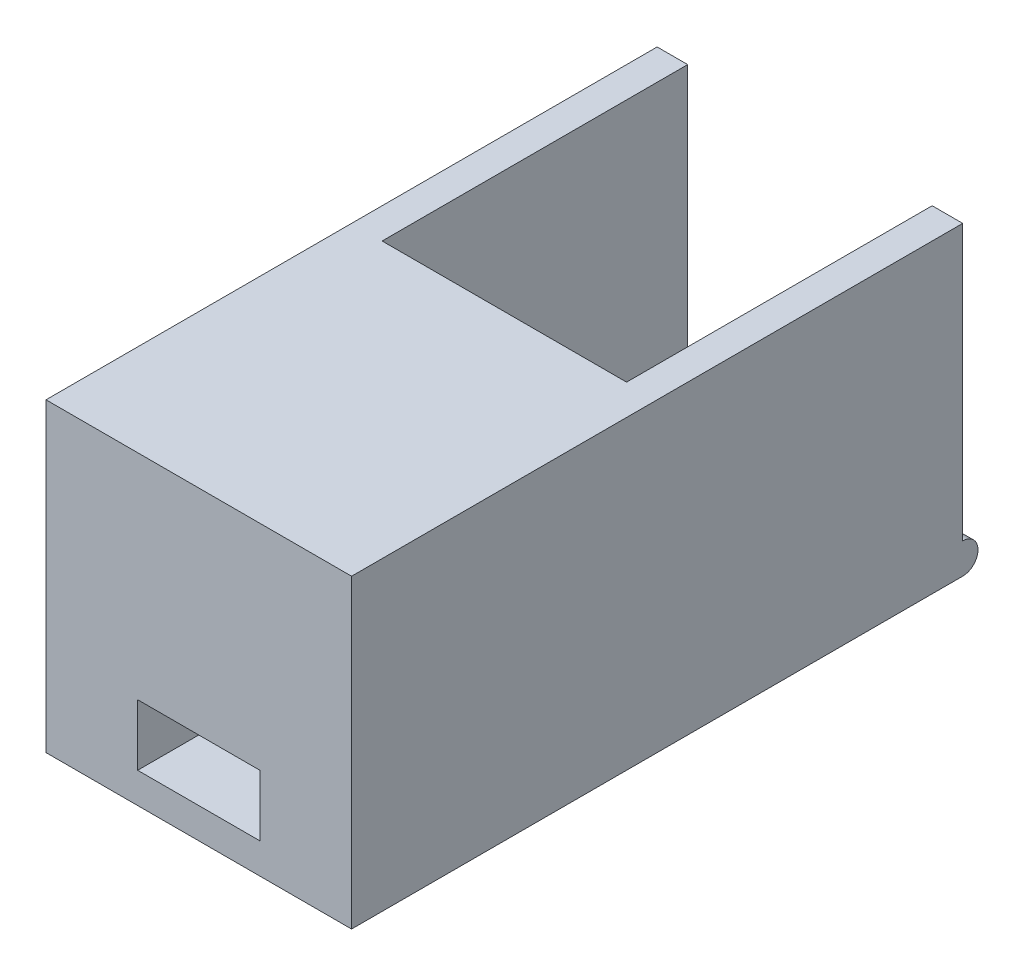
ISO-10303-21;
HEADER;
FILE_DESCRIPTION(('STEP AP214'),'2;1');
FILE_NAME('part.step','',(''),(''),'','','');
FILE_SCHEMA(('AUTOMOTIVE_DESIGN { 1 0 10303 214 1 1 1 1 }'));
ENDSEC;
DATA;
#1=APPLICATION_CONTEXT('core data for automotive mechanical design processes');
#2=APPLICATION_PROTOCOL_DEFINITION('international standard','automotive_design',2000,#1);
#3=PRODUCT_CONTEXT('',#1,'mechanical');
#4=PRODUCT('Part','Part','',(#3));
#5=PRODUCT_RELATED_PRODUCT_CATEGORY('part','',(#4));
#6=PRODUCT_DEFINITION_FORMATION('','',#4);
#7=PRODUCT_DEFINITION_CONTEXT('part definition',#1,'design');
#8=PRODUCT_DEFINITION('design','',#6,#7);
#9=PRODUCT_DEFINITION_SHAPE('','',#8);
#10=(LENGTH_UNIT() NAMED_UNIT(*) SI_UNIT(.MILLI.,.METRE.));
#11=(NAMED_UNIT(*) PLANE_ANGLE_UNIT() SI_UNIT($,.RADIAN.));
#12=(NAMED_UNIT(*) SI_UNIT($,.STERADIAN.) SOLID_ANGLE_UNIT());
#13=UNCERTAINTY_MEASURE_WITH_UNIT(LENGTH_MEASURE(1.E-05),#10,'distance_accuracy_value','');
#14=(GEOMETRIC_REPRESENTATION_CONTEXT(3) GLOBAL_UNCERTAINTY_ASSIGNED_CONTEXT((#13)) GLOBAL_UNIT_ASSIGNED_CONTEXT((#10,
#11,#12)) REPRESENTATION_CONTEXT('',''));
#15=CARTESIAN_POINT('',(0.,0.,0.));
#16=DIRECTION('',(0.,0.,1.));
#17=DIRECTION('',(1.,0.,0.));
#18=AXIS2_PLACEMENT_3D('',#15,#16,#17);
#19=CARTESIAN_POINT('',(-10.,20.,-20.));
#20=DIRECTION('',(0.,0.,1.));
#21=DIRECTION('',(1.,0.,0.));
#22=AXIS2_PLACEMENT_3D('',#19,#20,#21);
#23=PLANE('',#22);
#24=DIRECTION('',(0.,1.,0.));
#25=VECTOR('',#24,1.);
#26=CARTESIAN_POINT('',(-8.,2.,-20.));
#27=LINE('',#26,#25);
#28=CARTESIAN_POINT('',(-8.,2.,-20.));
#29=VERTEX_POINT('',#28);
#30=CARTESIAN_POINT('',(-8.,20.,-20.));
#31=VERTEX_POINT('',#30);
#32=EDGE_CURVE('E199',#29,#31,#27,.T.);
#33=ORIENTED_EDGE('',*,*,#32,.F.);
#34=DIRECTION('',(1.,0.,0.));
#35=VECTOR('',#34,1.);
#36=CARTESIAN_POINT('',(-10.,2.,-20.));
#37=LINE('',#36,#35);
#38=CARTESIAN_POINT('',(-10.,2.,-20.));
#39=VERTEX_POINT('',#38);
#40=EDGE_CURVE('E267',#29,#39,#37,.F.);
#41=ORIENTED_EDGE('',*,*,#40,.T.);
#42=DIRECTION('',(0.,-1.,0.));
#43=VECTOR('',#42,1.);
#44=CARTESIAN_POINT('',(-10.,20.,-20.));
#45=LINE('',#44,#43);
#46=CARTESIAN_POINT('',(-10.,20.,-20.));
#47=VERTEX_POINT('',#46);
#48=EDGE_CURVE('E220',#47,#39,#45,.T.);
#49=ORIENTED_EDGE('',*,*,#48,.F.);
#50=DIRECTION('',(-1.,0.,0.));
#51=VECTOR('',#50,1.);
#52=CARTESIAN_POINT('',(-10.,20.,-20.));
#53=LINE('',#52,#51);
#54=EDGE_CURVE('E216',#31,#47,#53,.T.);
#55=ORIENTED_EDGE('',*,*,#54,.F.);
#56=EDGE_LOOP('',(#33,#41,#49,#55));
#57=FACE_BOUND('',#56,.T.);
#58=ADVANCED_FACE('F34',(#57),#23,.F.);
#59=CARTESIAN_POINT('',(-10.,20.,-20.));
#60=DIRECTION('',(1.,0.,0.));
#61=DIRECTION('',(0.,0.,-1.));
#62=AXIS2_PLACEMENT_3D('',#59,#60,#61);
#63=PLANE('',#62);
#64=ORIENTED_EDGE('',*,*,#48,.T.);
#65=CARTESIAN_POINT('',(-10.,1.,-20.));
#66=DIRECTION('',(1.,0.,0.));
#67=DIRECTION('',(0.,0.,-1.));
#68=AXIS2_PLACEMENT_3D('',#65,#66,#67);
#69=CIRCLE('',#68,0.999999999999998);
#70=CARTESIAN_POINT('',(-10.,0.,-20.));
#71=VERTEX_POINT('',#70);
#72=EDGE_CURVE('E270',#71,#39,#69,.T.);
#73=ORIENTED_EDGE('',*,*,#72,.F.);
#74=DIRECTION('',(0.,0.,1.));
#75=VECTOR('',#74,1.);
#76=CARTESIAN_POINT('',(-10.,0.,-20.));
#77=LINE('',#76,#75);
#78=CARTESIAN_POINT('',(-10.,0.,20.));
#79=VERTEX_POINT('',#78);
#80=EDGE_CURVE('E201',#71,#79,#77,.T.);
#81=ORIENTED_EDGE('',*,*,#80,.T.);
#82=DIRECTION('',(0.,-1.,0.));
#83=VECTOR('',#82,1.);
#84=CARTESIAN_POINT('',(-10.,20.,20.));
#85=LINE('',#84,#83);
#86=CARTESIAN_POINT('',(-10.,20.,20.));
#87=VERTEX_POINT('',#86);
#88=EDGE_CURVE('E238',#87,#79,#85,.T.);
#89=ORIENTED_EDGE('',*,*,#88,.F.);
#90=DIRECTION('',(0.,0.,1.));
#91=VECTOR('',#90,1.);
#92=CARTESIAN_POINT('',(-10.,20.,-20.));
#93=LINE('',#92,#91);
#94=EDGE_CURVE('E208',#47,#87,#93,.T.);
#95=ORIENTED_EDGE('',*,*,#94,.F.);
#96=EDGE_LOOP('',(#64,#73,#81,#89,#95));
#97=FACE_BOUND('',#96,.T.);
#98=ADVANCED_FACE('F36',(#97),#63,.F.);
#99=CARTESIAN_POINT('',(-10.,20.,20.));
#100=DIRECTION('',(0.,0.,-1.));
#101=DIRECTION('',(-1.,0.,0.));
#102=AXIS2_PLACEMENT_3D('',#99,#100,#101);
#103=PLANE('',#102);
#104=DIRECTION('',(1.,0.,0.));
#105=VECTOR('',#104,1.);
#106=CARTESIAN_POINT('',(-10.,6.,20.));
#107=LINE('',#106,#105);
#108=CARTESIAN_POINT('',(-4.,6.,20.));
#109=VERTEX_POINT('',#108);
#110=CARTESIAN_POINT('',(4.,6.,20.));
#111=VERTEX_POINT('',#110);
#112=EDGE_CURVE('E284',#109,#111,#107,.T.);
#113=ORIENTED_EDGE('',*,*,#112,.T.);
#114=DIRECTION('',(0.,-1.,0.));
#115=VECTOR('',#114,1.);
#116=CARTESIAN_POINT('',(4.,20.,20.));
#117=LINE('',#116,#115);
#118=CARTESIAN_POINT('',(4.,2.,20.));
#119=VERTEX_POINT('',#118);
#120=EDGE_CURVE('E280',#111,#119,#117,.T.);
#121=ORIENTED_EDGE('',*,*,#120,.T.);
#122=DIRECTION('',(-1.,0.,0.));
#123=VECTOR('',#122,1.);
#124=CARTESIAN_POINT('',(-10.,2.,20.));
#125=LINE('',#124,#123);
#126=CARTESIAN_POINT('',(-4.,2.,20.));
#127=VERTEX_POINT('',#126);
#128=EDGE_CURVE('E288',#119,#127,#125,.T.);
#129=ORIENTED_EDGE('',*,*,#128,.T.);
#130=DIRECTION('',(0.,1.,0.));
#131=VECTOR('',#130,1.);
#132=CARTESIAN_POINT('',(-4.,20.,20.));
#133=LINE('',#132,#131);
#134=EDGE_CURVE('E158',#127,#109,#133,.T.);
#135=ORIENTED_EDGE('',*,*,#134,.T.);
#136=EDGE_LOOP('',(#113,#121,#129,#135));
#137=FACE_BOUND('',#136,.T.);
#138=DIRECTION('',(1.,0.,0.));
#139=VECTOR('',#138,1.);
#140=CARTESIAN_POINT('',(-10.,0.,20.));
#141=LINE('',#140,#139);
#142=CARTESIAN_POINT('',(10.,0.,20.));
#143=VERTEX_POINT('',#142);
#144=EDGE_CURVE('E223',#79,#143,#141,.T.);
#145=ORIENTED_EDGE('',*,*,#144,.T.);
#146=DIRECTION('',(0.,-1.,0.));
#147=VECTOR('',#146,1.);
#148=CARTESIAN_POINT('',(10.,20.,20.));
#149=LINE('',#148,#147);
#150=CARTESIAN_POINT('',(10.,20.,20.));
#151=VERTEX_POINT('',#150);
#152=EDGE_CURVE('E235',#151,#143,#149,.T.);
#153=ORIENTED_EDGE('',*,*,#152,.F.);
#154=DIRECTION('',(1.,0.,0.));
#155=VECTOR('',#154,1.);
#156=CARTESIAN_POINT('',(-10.,20.,20.));
#157=LINE('',#156,#155);
#158=EDGE_CURVE('E211',#87,#151,#157,.T.);
#159=ORIENTED_EDGE('',*,*,#158,.F.);
#160=ORIENTED_EDGE('',*,*,#88,.T.);
#161=EDGE_LOOP('',(#145,#153,#159,#160));
#162=FACE_BOUND('',#161,.T.);
#163=ADVANCED_FACE('F302',(#137,#162),#103,.F.);
#164=CARTESIAN_POINT('',(10.,20.,-20.));
#165=DIRECTION('',(-1.,0.,0.));
#166=DIRECTION('',(0.,0.,1.));
#167=AXIS2_PLACEMENT_3D('',#164,#165,#166);
#168=PLANE('',#167);
#169=DIRECTION('',(0.,0.,-1.));
#170=VECTOR('',#169,1.);
#171=CARTESIAN_POINT('',(10.,0.,-20.));
#172=LINE('',#171,#170);
#173=CARTESIAN_POINT('',(10.,0.,-20.));
#174=VERTEX_POINT('',#173);
#175=EDGE_CURVE('E225',#143,#174,#172,.T.);
#176=ORIENTED_EDGE('',*,*,#175,.T.);
#177=CARTESIAN_POINT('',(10.,1.,-20.));
#178=DIRECTION('',(-1.,0.,0.));
#179=DIRECTION('',(0.,0.,1.));
#180=AXIS2_PLACEMENT_3D('',#177,#178,#179);
#181=CIRCLE('',#180,0.999999999999998);
#182=CARTESIAN_POINT('',(10.,2.,-20.));
#183=VERTEX_POINT('',#182);
#184=EDGE_CURVE('E278',#183,#174,#181,.T.);
#185=ORIENTED_EDGE('',*,*,#184,.F.);
#186=DIRECTION('',(0.,-1.,0.));
#187=VECTOR('',#186,1.);
#188=CARTESIAN_POINT('',(10.,20.,-20.));
#189=LINE('',#188,#187);
#190=CARTESIAN_POINT('',(10.,20.,-20.));
#191=VERTEX_POINT('',#190);
#192=EDGE_CURVE('E232',#191,#183,#189,.T.);
#193=ORIENTED_EDGE('',*,*,#192,.F.);
#194=DIRECTION('',(0.,0.,-1.));
#195=VECTOR('',#194,1.);
#196=CARTESIAN_POINT('',(10.,20.,-20.));
#197=LINE('',#196,#195);
#198=EDGE_CURVE('E214',#151,#191,#197,.T.);
#199=ORIENTED_EDGE('',*,*,#198,.F.);
#200=ORIENTED_EDGE('',*,*,#152,.T.);
#201=EDGE_LOOP('',(#176,#185,#193,#199,#200));
#202=FACE_BOUND('',#201,.T.);
#203=ADVANCED_FACE('F305',(#202),#168,.F.);
#204=ORIENTED_EDGE('',*,*,#192,.T.);
#205=DIRECTION('',(-1.,0.,0.));
#206=VECTOR('',#205,1.);
#207=CARTESIAN_POINT('',(10.,2.,-20.));
#208=LINE('',#207,#206);
#209=CARTESIAN_POINT('',(8.,2.,-20.));
#210=VERTEX_POINT('',#209);
#211=EDGE_CURVE('E274',#183,#210,#208,.T.);
#212=ORIENTED_EDGE('',*,*,#211,.T.);
#213=DIRECTION('',(0.,1.,0.));
#214=VECTOR('',#213,1.);
#215=CARTESIAN_POINT('',(8.,2.,-20.));
#216=LINE('',#215,#214);
#217=CARTESIAN_POINT('',(8.,20.,-20.));
#218=VERTEX_POINT('',#217);
#219=EDGE_CURVE('E202',#210,#218,#216,.T.);
#220=ORIENTED_EDGE('',*,*,#219,.T.);
#221=EDGE_CURVE('E217',#191,#218,#53,.T.);
#222=ORIENTED_EDGE('',*,*,#221,.F.);
#223=EDGE_LOOP('',(#204,#212,#220,#222));
#224=FACE_BOUND('',#223,.T.);
#225=ADVANCED_FACE('F322',(#224),#23,.F.);
#226=CARTESIAN_POINT('',(0.,20.,0.));
#227=DIRECTION('',(0.,1.,0.));
#228=DIRECTION('',(0.,0.,1.));
#229=AXIS2_PLACEMENT_3D('',#226,#227,#228);
#230=PLANE('',#229);
#231=DIRECTION('',(0.,0.,1.));
#232=VECTOR('',#231,1.);
#233=CARTESIAN_POINT('',(-8.,20.,-20.));
#234=LINE('',#233,#232);
#235=CARTESIAN_POINT('',(-8.,20.,0.));
#236=VERTEX_POINT('',#235);
#237=EDGE_CURVE('E191',#31,#236,#234,.T.);
#238=ORIENTED_EDGE('',*,*,#237,.F.);
#239=ORIENTED_EDGE('',*,*,#54,.T.);
#240=ORIENTED_EDGE('',*,*,#94,.T.);
#241=ORIENTED_EDGE('',*,*,#158,.T.);
#242=ORIENTED_EDGE('',*,*,#198,.T.);
#243=ORIENTED_EDGE('',*,*,#221,.T.);
#244=DIRECTION('',(0.,0.,-1.));
#245=VECTOR('',#244,1.);
#246=CARTESIAN_POINT('',(8.,20.,-20.));
#247=LINE('',#246,#245);
#248=CARTESIAN_POINT('',(8.,20.,0.));
#249=VERTEX_POINT('',#248);
#250=EDGE_CURVE('E197',#249,#218,#247,.T.);
#251=ORIENTED_EDGE('',*,*,#250,.F.);
#252=DIRECTION('',(1.,0.,0.));
#253=VECTOR('',#252,1.);
#254=CARTESIAN_POINT('',(-8.,20.,0.));
#255=LINE('',#254,#253);
#256=EDGE_CURVE('E193',#236,#249,#255,.T.);
#257=ORIENTED_EDGE('',*,*,#256,.F.);
#258=EDGE_LOOP('',(#238,#239,#240,#241,#242,#243,#251,#257));
#259=FACE_BOUND('',#258,.T.);
#260=ADVANCED_FACE('F327',(#259),#230,.T.);
#261=CARTESIAN_POINT('',(0.,0.,0.));
#262=DIRECTION('',(0.,1.,0.));
#263=DIRECTION('',(0.,0.,1.));
#264=AXIS2_PLACEMENT_3D('',#261,#262,#263);
#265=PLANE('',#264);
#266=DIRECTION('',(-1.,0.,0.));
#267=VECTOR('',#266,1.);
#268=CARTESIAN_POINT('',(-10.,0.,-20.));
#269=LINE('',#268,#267);
#270=CARTESIAN_POINT('',(-4.,0.,-20.));
#271=VERTEX_POINT('',#270);
#272=EDGE_CURVE('E228',#271,#71,#269,.T.);
#273=ORIENTED_EDGE('',*,*,#272,.F.);
#274=DIRECTION('',(0.,0.,-1.));
#275=VECTOR('',#274,1.);
#276=CARTESIAN_POINT('',(-4.,0.,-42.4027351839628));
#277=LINE('',#276,#275);
#278=CARTESIAN_POINT('',(-4.,0.,-4.));
#279=VERTEX_POINT('',#278);
#280=EDGE_CURVE('E264',#279,#271,#277,.T.);
#281=ORIENTED_EDGE('',*,*,#280,.F.);
#282=DIRECTION('',(-1.,0.,0.));
#283=VECTOR('',#282,1.);
#284=CARTESIAN_POINT('',(-4.,0.,-4.));
#285=LINE('',#284,#283);
#286=CARTESIAN_POINT('',(4.,0.,-4.));
#287=VERTEX_POINT('',#286);
#288=EDGE_CURVE('E259',#287,#279,#285,.T.);
#289=ORIENTED_EDGE('',*,*,#288,.F.);
#290=DIRECTION('',(0.,0.,1.));
#291=VECTOR('',#290,1.);
#292=CARTESIAN_POINT('',(4.,0.,-42.4027351839628));
#293=LINE('',#292,#291);
#294=CARTESIAN_POINT('',(4.,0.,-20.));
#295=VERTEX_POINT('',#294);
#296=EDGE_CURVE('E257',#295,#287,#293,.T.);
#297=ORIENTED_EDGE('',*,*,#296,.F.);
#298=EDGE_CURVE('E212',#174,#295,#269,.T.);
#299=ORIENTED_EDGE('',*,*,#298,.F.);
#300=ORIENTED_EDGE('',*,*,#175,.F.);
#301=ORIENTED_EDGE('',*,*,#144,.F.);
#302=ORIENTED_EDGE('',*,*,#80,.F.);
#303=EDGE_LOOP('',(#273,#281,#289,#297,#299,#300,#301,#302));
#304=FACE_BOUND('',#303,.T.);
#305=ADVANCED_FACE('F317',(#304),#265,.F.);
#306=CARTESIAN_POINT('',(-8.,2.,-20.));
#307=DIRECTION('',(-1.,0.,0.));
#308=DIRECTION('',(0.,0.,1.));
#309=AXIS2_PLACEMENT_3D('',#306,#307,#308);
#310=PLANE('',#309);
#311=ORIENTED_EDGE('',*,*,#237,.T.);
#312=DIRECTION('',(0.,1.,0.));
#313=VECTOR('',#312,1.);
#314=CARTESIAN_POINT('',(-8.,2.,0.));
#315=LINE('',#314,#313);
#316=CARTESIAN_POINT('',(-8.,2.,0.));
#317=VERTEX_POINT('',#316);
#318=EDGE_CURVE('E190',#317,#236,#315,.T.);
#319=ORIENTED_EDGE('',*,*,#318,.F.);
#320=DIRECTION('',(0.,0.,1.));
#321=VECTOR('',#320,1.);
#322=CARTESIAN_POINT('',(-8.,2.,-20.));
#323=LINE('',#322,#321);
#324=EDGE_CURVE('E177',#29,#317,#323,.T.);
#325=ORIENTED_EDGE('',*,*,#324,.F.);
#326=ORIENTED_EDGE('',*,*,#32,.T.);
#327=EDGE_LOOP('',(#311,#319,#325,#326));
#328=FACE_BOUND('',#327,.T.);
#329=ADVANCED_FACE('F341',(#328),#310,.F.);
#330=CARTESIAN_POINT('',(8.,2.,-20.));
#331=DIRECTION('',(1.,0.,0.));
#332=DIRECTION('',(0.,0.,-1.));
#333=AXIS2_PLACEMENT_3D('',#330,#331,#332);
#334=PLANE('',#333);
#335=ORIENTED_EDGE('',*,*,#250,.T.);
#336=ORIENTED_EDGE('',*,*,#219,.F.);
#337=DIRECTION('',(0.,0.,-1.));
#338=VECTOR('',#337,1.);
#339=CARTESIAN_POINT('',(8.,2.,-20.));
#340=LINE('',#339,#338);
#341=CARTESIAN_POINT('',(8.,2.,0.));
#342=VERTEX_POINT('',#341);
#343=EDGE_CURVE('E178',#342,#210,#340,.T.);
#344=ORIENTED_EDGE('',*,*,#343,.F.);
#345=DIRECTION('',(0.,1.,0.));
#346=VECTOR('',#345,1.);
#347=CARTESIAN_POINT('',(8.,2.,0.));
#348=LINE('',#347,#346);
#349=EDGE_CURVE('E205',#342,#249,#348,.T.);
#350=ORIENTED_EDGE('',*,*,#349,.T.);
#351=EDGE_LOOP('',(#335,#336,#344,#350));
#352=FACE_BOUND('',#351,.T.);
#353=ADVANCED_FACE('F384',(#352),#334,.F.);
#354=CARTESIAN_POINT('',(-8.,2.,0.));
#355=DIRECTION('',(0.,0.,1.));
#356=DIRECTION('',(1.,0.,0.));
#357=AXIS2_PLACEMENT_3D('',#354,#355,#356);
#358=PLANE('',#357);
#359=DIRECTION('',(1.,0.,0.));
#360=VECTOR('',#359,1.);
#361=CARTESIAN_POINT('',(-8.,2.,0.));
#362=LINE('',#361,#360);
#363=CARTESIAN_POINT('',(4.,2.,0.));
#364=VERTEX_POINT('',#363);
#365=EDGE_CURVE('E179',#364,#342,#362,.T.);
#366=ORIENTED_EDGE('',*,*,#365,.F.);
#367=DIRECTION('',(0.,-1.,0.));
#368=VECTOR('',#367,1.);
#369=CARTESIAN_POINT('',(4.,2.,0.));
#370=LINE('',#369,#368);
#371=CARTESIAN_POINT('',(4.,6.,0.));
#372=VERTEX_POINT('',#371);
#373=EDGE_CURVE('E57',#372,#364,#370,.T.);
#374=ORIENTED_EDGE('',*,*,#373,.F.);
#375=DIRECTION('',(1.,0.,0.));
#376=VECTOR('',#375,1.);
#377=CARTESIAN_POINT('',(4.,6.,0.));
#378=LINE('',#377,#376);
#379=CARTESIAN_POINT('',(-4.,6.,0.));
#380=VERTEX_POINT('',#379);
#381=EDGE_CURVE('E171',#380,#372,#378,.T.);
#382=ORIENTED_EDGE('',*,*,#381,.F.);
#383=DIRECTION('',(0.,1.,0.));
#384=VECTOR('',#383,1.);
#385=CARTESIAN_POINT('',(-4.,2.,0.));
#386=LINE('',#385,#384);
#387=CARTESIAN_POINT('',(-4.,2.,0.));
#388=VERTEX_POINT('',#387);
#389=EDGE_CURVE('E155',#388,#380,#386,.T.);
#390=ORIENTED_EDGE('',*,*,#389,.F.);
#391=EDGE_CURVE('E168',#317,#388,#362,.T.);
#392=ORIENTED_EDGE('',*,*,#391,.F.);
#393=ORIENTED_EDGE('',*,*,#318,.T.);
#394=ORIENTED_EDGE('',*,*,#256,.T.);
#395=ORIENTED_EDGE('',*,*,#349,.F.);
#396=EDGE_LOOP('',(#366,#374,#382,#390,#392,#393,#394,#395));
#397=FACE_BOUND('',#396,.T.);
#398=ADVANCED_FACE('F166',(#397),#358,.F.);
#399=CARTESIAN_POINT('',(0.,2.,0.));
#400=DIRECTION('',(0.,1.,0.));
#401=DIRECTION('',(0.,0.,1.));
#402=AXIS2_PLACEMENT_3D('',#399,#400,#401);
#403=PLANE('',#402);
#404=DIRECTION('',(0.,0.,1.));
#405=VECTOR('',#404,1.);
#406=CARTESIAN_POINT('',(-4.,2.,0.));
#407=LINE('',#406,#405);
#408=CARTESIAN_POINT('',(-4.,2.,-20.));
#409=VERTEX_POINT('',#408);
#410=CARTESIAN_POINT('',(-4.,2.,-4.));
#411=VERTEX_POINT('',#410);
#412=EDGE_CURVE('E11',#409,#411,#407,.T.);
#413=ORIENTED_EDGE('',*,*,#412,.F.);
#414=DIRECTION('',(-1.,0.,0.));
#415=VECTOR('',#414,1.);
#416=CARTESIAN_POINT('',(-8.,2.,-20.));
#417=LINE('',#416,#415);
#418=EDGE_CURVE('E182',#409,#29,#417,.T.);
#419=ORIENTED_EDGE('',*,*,#418,.T.);
#420=ORIENTED_EDGE('',*,*,#324,.T.);
#421=ORIENTED_EDGE('',*,*,#391,.T.);
#422=DIRECTION('',(0.,0.,-1.));
#423=VECTOR('',#422,1.);
#424=CARTESIAN_POINT('',(-4.,2.,30.));
#425=LINE('',#424,#423);
#426=EDGE_CURVE('E49',#127,#388,#425,.T.);
#427=ORIENTED_EDGE('',*,*,#426,.F.);
#428=ORIENTED_EDGE('',*,*,#128,.F.);
#429=DIRECTION('',(0.,0.,-1.));
#430=VECTOR('',#429,1.);
#431=CARTESIAN_POINT('',(4.,2.,30.));
#432=LINE('',#431,#430);
#433=EDGE_CURVE('E161',#119,#364,#432,.T.);
#434=ORIENTED_EDGE('',*,*,#433,.T.);
#435=ORIENTED_EDGE('',*,*,#365,.T.);
#436=ORIENTED_EDGE('',*,*,#343,.T.);
#437=CARTESIAN_POINT('',(4.,2.,-20.));
#438=VERTEX_POINT('',#437);
#439=EDGE_CURVE('E187',#210,#438,#417,.T.);
#440=ORIENTED_EDGE('',*,*,#439,.T.);
#441=DIRECTION('',(0.,0.,-1.));
#442=VECTOR('',#441,1.);
#443=CARTESIAN_POINT('',(4.,2.,0.));
#444=LINE('',#443,#442);
#445=CARTESIAN_POINT('',(4.,2.,-4.));
#446=VERTEX_POINT('',#445);
#447=EDGE_CURVE('E241',#446,#438,#444,.T.);
#448=ORIENTED_EDGE('',*,*,#447,.F.);
#449=DIRECTION('',(1.,0.,0.));
#450=VECTOR('',#449,1.);
#451=CARTESIAN_POINT('',(0.,2.,-4.));
#452=LINE('',#451,#450);
#453=EDGE_CURVE('E42',#411,#446,#452,.T.);
#454=ORIENTED_EDGE('',*,*,#453,.F.);
#455=EDGE_LOOP('',(#413,#419,#420,#421,#427,#428,#434,#435,#436,#440,#448,#454));
#456=FACE_BOUND('',#455,.T.);
#457=ADVANCED_FACE('F174',(#456),#403,.T.);
#458=CARTESIAN_POINT('',(-4.,20.,-42.4027351839628));
#459=DIRECTION('',(-1.,0.,0.));
#460=DIRECTION('',(0.,0.,1.));
#461=AXIS2_PLACEMENT_3D('',#458,#459,#460);
#462=PLANE('',#461);
#463=ORIENTED_EDGE('',*,*,#280,.T.);
#464=CARTESIAN_POINT('',(-4.,1.,-20.));
#465=DIRECTION('',(1.,0.,0.));
#466=DIRECTION('',(0.,0.,-1.));
#467=AXIS2_PLACEMENT_3D('',#464,#465,#466);
#468=CIRCLE('',#467,0.999999999999998);
#469=EDGE_CURVE('E271',#271,#409,#468,.T.);
#470=ORIENTED_EDGE('',*,*,#469,.T.);
#471=ORIENTED_EDGE('',*,*,#412,.T.);
#472=DIRECTION('',(0.,-1.,0.));
#473=VECTOR('',#472,1.);
#474=CARTESIAN_POINT('',(-4.,20.,-4.));
#475=LINE('',#474,#473);
#476=EDGE_CURVE('E194',#411,#279,#475,.T.);
#477=ORIENTED_EDGE('',*,*,#476,.T.);
#478=EDGE_LOOP('',(#463,#470,#471,#477));
#479=FACE_BOUND('',#478,.T.);
#480=ADVANCED_FACE('F338',(#479),#462,.F.);
#481=CARTESIAN_POINT('',(4.,20.,-42.4027351839628));
#482=DIRECTION('',(1.,0.,0.));
#483=DIRECTION('',(0.,0.,-1.));
#484=AXIS2_PLACEMENT_3D('',#481,#482,#483);
#485=PLANE('',#484);
#486=ORIENTED_EDGE('',*,*,#447,.T.);
#487=CARTESIAN_POINT('',(4.,1.,-20.));
#488=DIRECTION('',(-1.,0.,0.));
#489=DIRECTION('',(0.,0.,1.));
#490=AXIS2_PLACEMENT_3D('',#487,#488,#489);
#491=CIRCLE('',#490,0.999999999999998);
#492=EDGE_CURVE('E255',#438,#295,#491,.T.);
#493=ORIENTED_EDGE('',*,*,#492,.T.);
#494=ORIENTED_EDGE('',*,*,#296,.T.);
#495=DIRECTION('',(0.,-1.,0.));
#496=VECTOR('',#495,1.);
#497=CARTESIAN_POINT('',(4.,20.,-4.));
#498=LINE('',#497,#496);
#499=EDGE_CURVE('E250',#446,#287,#498,.T.);
#500=ORIENTED_EDGE('',*,*,#499,.F.);
#501=EDGE_LOOP('',(#486,#493,#494,#500));
#502=FACE_BOUND('',#501,.T.);
#503=ADVANCED_FACE('F254',(#502),#485,.F.);
#504=CARTESIAN_POINT('',(-4.,20.,-4.));
#505=DIRECTION('',(0.,0.,1.));
#506=DIRECTION('',(1.,0.,0.));
#507=AXIS2_PLACEMENT_3D('',#504,#505,#506);
#508=PLANE('',#507);
#509=ORIENTED_EDGE('',*,*,#453,.T.);
#510=ORIENTED_EDGE('',*,*,#499,.T.);
#511=ORIENTED_EDGE('',*,*,#288,.T.);
#512=ORIENTED_EDGE('',*,*,#476,.F.);
#513=EDGE_LOOP('',(#509,#510,#511,#512));
#514=FACE_BOUND('',#513,.T.);
#515=ADVANCED_FACE('F248',(#514),#508,.F.);
#516=CARTESIAN_POINT('',(-10.,1.,-20.));
#517=DIRECTION('',(1.,0.,0.));
#518=DIRECTION('',(0.,0.,-1.));
#519=AXIS2_PLACEMENT_3D('',#516,#517,#518);
#520=CYLINDRICAL_SURFACE('',#519,0.999999999999998);
#521=ORIENTED_EDGE('',*,*,#272,.T.);
#522=ORIENTED_EDGE('',*,*,#72,.T.);
#523=ORIENTED_EDGE('',*,*,#40,.F.);
#524=ORIENTED_EDGE('',*,*,#418,.F.);
#525=ORIENTED_EDGE('',*,*,#469,.F.);
#526=EDGE_LOOP('',(#521,#522,#523,#524,#525));
#527=FACE_BOUND('',#526,.T.);
#528=ADVANCED_FACE('F336',(#527),#520,.T.);
#529=CARTESIAN_POINT('',(10.,1.,-20.));
#530=DIRECTION('',(-1.,0.,0.));
#531=DIRECTION('',(0.,0.,1.));
#532=AXIS2_PLACEMENT_3D('',#529,#530,#531);
#533=CYLINDRICAL_SURFACE('',#532,0.999999999999998);
#534=ORIENTED_EDGE('',*,*,#184,.T.);
#535=ORIENTED_EDGE('',*,*,#298,.T.);
#536=ORIENTED_EDGE('',*,*,#492,.F.);
#537=ORIENTED_EDGE('',*,*,#439,.F.);
#538=ORIENTED_EDGE('',*,*,#211,.F.);
#539=EDGE_LOOP('',(#534,#535,#536,#537,#538));
#540=FACE_BOUND('',#539,.T.);
#541=ADVANCED_FACE('F319',(#540),#533,.T.);
#542=CARTESIAN_POINT('',(4.,2.,30.));
#543=DIRECTION('',(1.,0.,0.));
#544=DIRECTION('',(0.,0.,-1.));
#545=AXIS2_PLACEMENT_3D('',#542,#543,#544);
#546=PLANE('',#545);
#547=DIRECTION('',(0.,0.,-1.));
#548=VECTOR('',#547,1.);
#549=CARTESIAN_POINT('',(4.,6.,30.));
#550=LINE('',#549,#548);
#551=EDGE_CURVE('E290',#111,#372,#550,.T.);
#552=ORIENTED_EDGE('',*,*,#551,.T.);
#553=ORIENTED_EDGE('',*,*,#373,.T.);
#554=ORIENTED_EDGE('',*,*,#433,.F.);
#555=ORIENTED_EDGE('',*,*,#120,.F.);
#556=EDGE_LOOP('',(#552,#553,#554,#555));
#557=FACE_BOUND('',#556,.T.);
#558=ADVANCED_FACE('F300',(#557),#546,.F.);
#559=CARTESIAN_POINT('',(4.,6.,30.));
#560=DIRECTION('',(0.,1.,0.));
#561=DIRECTION('',(0.,0.,1.));
#562=AXIS2_PLACEMENT_3D('',#559,#560,#561);
#563=PLANE('',#562);
#564=DIRECTION('',(0.,0.,-1.));
#565=VECTOR('',#564,1.);
#566=CARTESIAN_POINT('',(-4.,6.,30.));
#567=LINE('',#566,#565);
#568=EDGE_CURVE('E160',#109,#380,#567,.T.);
#569=ORIENTED_EDGE('',*,*,#568,.T.);
#570=ORIENTED_EDGE('',*,*,#381,.T.);
#571=ORIENTED_EDGE('',*,*,#551,.F.);
#572=ORIENTED_EDGE('',*,*,#112,.F.);
#573=EDGE_LOOP('',(#569,#570,#571,#572));
#574=FACE_BOUND('',#573,.T.);
#575=ADVANCED_FACE('F297',(#574),#563,.F.);
#576=CARTESIAN_POINT('',(-4.,2.,30.));
#577=DIRECTION('',(-1.,0.,0.));
#578=DIRECTION('',(0.,0.,1.));
#579=AXIS2_PLACEMENT_3D('',#576,#577,#578);
#580=PLANE('',#579);
#581=ORIENTED_EDGE('',*,*,#426,.T.);
#582=ORIENTED_EDGE('',*,*,#389,.T.);
#583=ORIENTED_EDGE('',*,*,#568,.F.);
#584=ORIENTED_EDGE('',*,*,#134,.F.);
#585=EDGE_LOOP('',(#581,#582,#583,#584));
#586=FACE_BOUND('',#585,.T.);
#587=ADVANCED_FACE('F153',(#586),#580,.F.);
#588=CLOSED_SHELL('',(#58,#98,#163,#203,#225,#260,#305,#329,#353,#398,#457,#480,#503,#515,#528,
#541,#558,#575,#587));
#589=MANIFOLD_SOLID_BREP('B2',#588);
#590=ADVANCED_BREP_SHAPE_REPRESENTATION('',(#18,#589),#14);
#591=SHAPE_DEFINITION_REPRESENTATION(#9,#590);
ENDSEC;
END-ISO-10303-21;
